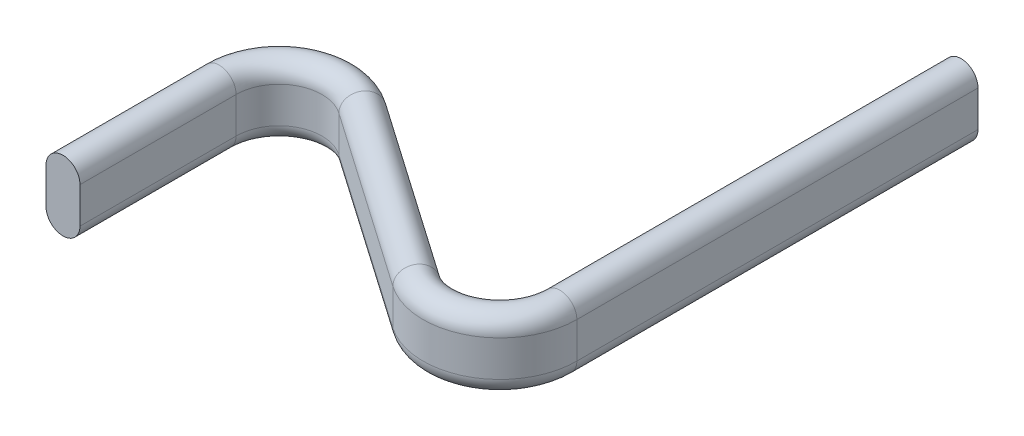
ISO-10303-21;
HEADER;
FILE_DESCRIPTION(('STEP AP214'),'2;1');
FILE_NAME('part.step','',(''),(''),'','','');
FILE_SCHEMA(('AUTOMOTIVE_DESIGN { 1 0 10303 214 1 1 1 1 }'));
ENDSEC;
DATA;
#1=APPLICATION_CONTEXT('core data for automotive mechanical design processes');
#2=APPLICATION_PROTOCOL_DEFINITION('international standard','automotive_design',2000,#1);
#3=PRODUCT_CONTEXT('',#1,'mechanical');
#4=PRODUCT('Part','Part','',(#3));
#5=PRODUCT_RELATED_PRODUCT_CATEGORY('part','',(#4));
#6=PRODUCT_DEFINITION_FORMATION('','',#4);
#7=PRODUCT_DEFINITION_CONTEXT('part definition',#1,'design');
#8=PRODUCT_DEFINITION('design','',#6,#7);
#9=PRODUCT_DEFINITION_SHAPE('','',#8);
#10=(LENGTH_UNIT() NAMED_UNIT(*) SI_UNIT(.MILLI.,.METRE.));
#11=(NAMED_UNIT(*) PLANE_ANGLE_UNIT() SI_UNIT($,.RADIAN.));
#12=(NAMED_UNIT(*) SI_UNIT($,.STERADIAN.) SOLID_ANGLE_UNIT());
#13=UNCERTAINTY_MEASURE_WITH_UNIT(LENGTH_MEASURE(1.E-05),#10,'distance_accuracy_value','');
#14=(GEOMETRIC_REPRESENTATION_CONTEXT(3) GLOBAL_UNCERTAINTY_ASSIGNED_CONTEXT((#13)) GLOBAL_UNIT_ASSIGNED_CONTEXT((#10,
#11,#12)) REPRESENTATION_CONTEXT('',''));
#15=CARTESIAN_POINT('',(0.,0.,0.));
#16=DIRECTION('',(0.,0.,1.));
#17=DIRECTION('',(1.,0.,0.));
#18=AXIS2_PLACEMENT_3D('',#15,#16,#17);
#19=CARTESIAN_POINT('',(0.,-1.8,0.));
#20=DIRECTION('',(0.,0.,1.));
#21=DIRECTION('',(1.,0.,0.));
#22=AXIS2_PLACEMENT_3D('',#19,#20,#21);
#23=PLANE('',#22);
#24=CARTESIAN_POINT('',(0.,-1.8,0.));
#25=DIRECTION('',(0.,0.,1.));
#26=DIRECTION('',(1.,0.,0.));
#27=AXIS2_PLACEMENT_3D('',#24,#25,#26);
#28=CIRCLE('',#27,1.7);
#29=CARTESIAN_POINT('',(-1.7,-1.8,0.));
#30=VERTEX_POINT('',#29);
#31=CARTESIAN_POINT('',(1.7,-1.8,0.));
#32=VERTEX_POINT('',#31);
#33=EDGE_CURVE('E151',#30,#32,#28,.T.);
#34=ORIENTED_EDGE('',*,*,#33,.T.);
#35=DIRECTION('',(0.,1.,0.));
#36=VECTOR('',#35,1.);
#37=CARTESIAN_POINT('',(1.7,-1.8,0.));
#38=LINE('',#37,#36);
#39=CARTESIAN_POINT('',(1.7,1.8,0.));
#40=VERTEX_POINT('',#39);
#41=EDGE_CURVE('E155',#32,#40,#38,.T.);
#42=ORIENTED_EDGE('',*,*,#41,.T.);
#43=CARTESIAN_POINT('',(0.,1.8,0.));
#44=DIRECTION('',(0.,0.,1.));
#45=DIRECTION('',(1.,0.,0.));
#46=AXIS2_PLACEMENT_3D('',#43,#44,#45);
#47=CIRCLE('',#46,1.7);
#48=CARTESIAN_POINT('',(-1.7,1.8,0.));
#49=VERTEX_POINT('',#48);
#50=EDGE_CURVE('E154',#40,#49,#47,.T.);
#51=ORIENTED_EDGE('',*,*,#50,.T.);
#52=DIRECTION('',(0.,-1.,0.));
#53=VECTOR('',#52,1.);
#54=CARTESIAN_POINT('',(-1.7,-1.8,0.));
#55=LINE('',#54,#53);
#56=EDGE_CURVE('E141',#49,#30,#55,.T.);
#57=ORIENTED_EDGE('',*,*,#56,.T.);
#58=EDGE_LOOP('',(#34,#42,#51,#57));
#59=FACE_BOUND('',#58,.T.);
#60=ADVANCED_FACE('F33',(#59),#23,.T.);
#61=CARTESIAN_POINT('',(36.5670970558212,-1.8,-53.3285901270254));
#62=DIRECTION('',(0.,0.,1.));
#63=DIRECTION('',(1.,0.,0.));
#64=AXIS2_PLACEMENT_3D('',#61,#62,#63);
#65=PLANE('',#64);
#66=CARTESIAN_POINT('',(36.5670970558212,-1.8,-53.3285901270254));
#67=DIRECTION('',(0.,0.,1.));
#68=DIRECTION('',(1.,0.,0.));
#69=AXIS2_PLACEMENT_3D('',#66,#67,#68);
#70=CIRCLE('',#69,1.7);
#71=CARTESIAN_POINT('',(34.8670970558212,-1.8,-53.3285901270254));
#72=VERTEX_POINT('',#71);
#73=CARTESIAN_POINT('',(38.2670970558212,-1.8,-53.3285901270254));
#74=VERTEX_POINT('',#73);
#75=EDGE_CURVE('E56',#72,#74,#70,.T.);
#76=ORIENTED_EDGE('',*,*,#75,.F.);
#77=DIRECTION('',(0.,-1.,0.));
#78=VECTOR('',#77,1.);
#79=CARTESIAN_POINT('',(34.8670970558212,-1.8,-53.3285901270254));
#80=LINE('',#79,#78);
#81=CARTESIAN_POINT('',(34.8670970558212,1.8,-53.3285901270254));
#82=VERTEX_POINT('',#81);
#83=EDGE_CURVE('E199',#82,#72,#80,.T.);
#84=ORIENTED_EDGE('',*,*,#83,.F.);
#85=CARTESIAN_POINT('',(36.5670970558212,1.8,-53.3285901270254));
#86=DIRECTION('',(0.,0.,1.));
#87=DIRECTION('',(1.,0.,0.));
#88=AXIS2_PLACEMENT_3D('',#85,#86,#87);
#89=CIRCLE('',#88,1.7);
#90=CARTESIAN_POINT('',(38.2670970558212,1.8,-53.3285901270254));
#91=VERTEX_POINT('',#90);
#92=EDGE_CURVE('E11',#91,#82,#89,.T.);
#93=ORIENTED_EDGE('',*,*,#92,.F.);
#94=DIRECTION('',(0.,1.,0.));
#95=VECTOR('',#94,1.);
#96=CARTESIAN_POINT('',(38.2670970558212,-1.8,-53.3285901270254));
#97=LINE('',#96,#95);
#98=EDGE_CURVE('E47',#74,#91,#97,.T.);
#99=ORIENTED_EDGE('',*,*,#98,.F.);
#100=EDGE_LOOP('',(#76,#84,#93,#99));
#101=FACE_BOUND('',#100,.T.);
#102=ADVANCED_FACE('F303',(#101),#65,.F.);
#103=CARTESIAN_POINT('',(-1.7,-1.8,0.));
#104=DIRECTION('',(1.,0.,0.));
#105=DIRECTION('',(0.,1.,0.));
#106=AXIS2_PLACEMENT_3D('',#103,#104,#105);
#107=PLANE('',#106);
#108=DIRECTION('',(0.,0.,-1.));
#109=VECTOR('',#108,1.);
#110=CARTESIAN_POINT('',(-1.7,-1.8,0.));
#111=LINE('',#110,#109);
#112=CARTESIAN_POINT('',(-1.7,-1.8,-15.6317225175573));
#113=VERTEX_POINT('',#112);
#114=EDGE_CURVE('E148',#30,#113,#111,.T.);
#115=ORIENTED_EDGE('',*,*,#114,.F.);
#116=ORIENTED_EDGE('',*,*,#56,.F.);
#117=DIRECTION('',(0.,0.,-1.));
#118=VECTOR('',#117,1.);
#119=CARTESIAN_POINT('',(-1.7,1.8,0.));
#120=LINE('',#119,#118);
#121=CARTESIAN_POINT('',(-1.7,1.8,-15.6317225175573));
#122=VERTEX_POINT('',#121);
#123=EDGE_CURVE('E146',#49,#122,#120,.T.);
#124=ORIENTED_EDGE('',*,*,#123,.T.);
#125=DIRECTION('',(0.,-1.,0.));
#126=VECTOR('',#125,1.);
#127=CARTESIAN_POINT('',(-1.7,-1.8,-15.6317225175573));
#128=LINE('',#127,#126);
#129=EDGE_CURVE('E165',#122,#113,#128,.T.);
#130=ORIENTED_EDGE('',*,*,#129,.T.);
#131=EDGE_LOOP('',(#115,#116,#124,#130));
#132=FACE_BOUND('',#131,.T.);
#133=ADVANCED_FACE('F143',(#132),#107,.F.);
#134=CARTESIAN_POINT('',(0.,-1.8,0.));
#135=DIRECTION('',(0.,0.,-1.));
#136=DIRECTION('',(-1.,0.,0.));
#137=AXIS2_PLACEMENT_3D('',#134,#135,#136);
#138=CYLINDRICAL_SURFACE('',#137,1.7);
#139=DIRECTION('',(0.,0.,-1.));
#140=VECTOR('',#139,1.);
#141=CARTESIAN_POINT('',(1.7,-1.8,0.));
#142=LINE('',#141,#140);
#143=CARTESIAN_POINT('',(1.7,-1.8,-15.6317225175573));
#144=VERTEX_POINT('',#143);
#145=EDGE_CURVE('E210',#32,#144,#142,.T.);
#146=ORIENTED_EDGE('',*,*,#145,.F.);
#147=ORIENTED_EDGE('',*,*,#33,.F.);
#148=ORIENTED_EDGE('',*,*,#114,.T.);
#149=CARTESIAN_POINT('',(0.,-1.8,-15.6317225175573));
#150=DIRECTION('',(0.,0.,1.));
#151=DIRECTION('',(1.,0.,0.));
#152=AXIS2_PLACEMENT_3D('',#149,#150,#151);
#153=CIRCLE('',#152,1.7);
#154=EDGE_CURVE('E207',#113,#144,#153,.T.);
#155=ORIENTED_EDGE('',*,*,#154,.T.);
#156=EDGE_LOOP('',(#146,#147,#148,#155));
#157=FACE_BOUND('',#156,.T.);
#158=ADVANCED_FACE('F310',(#157),#138,.T.);
#159=CARTESIAN_POINT('',(1.7,-1.8,0.));
#160=DIRECTION('',(-1.,0.,0.));
#161=DIRECTION('',(0.,0.,1.));
#162=AXIS2_PLACEMENT_3D('',#159,#160,#161);
#163=PLANE('',#162);
#164=DIRECTION('',(0.,0.,-1.));
#165=VECTOR('',#164,1.);
#166=CARTESIAN_POINT('',(1.7,1.8,0.));
#167=LINE('',#166,#165);
#168=CARTESIAN_POINT('',(1.7,1.8,-15.6317225175573));
#169=VERTEX_POINT('',#168);
#170=EDGE_CURVE('E234',#40,#169,#167,.T.);
#171=ORIENTED_EDGE('',*,*,#170,.F.);
#172=ORIENTED_EDGE('',*,*,#41,.F.);
#173=ORIENTED_EDGE('',*,*,#145,.T.);
#174=DIRECTION('',(0.,1.,0.));
#175=VECTOR('',#174,1.);
#176=CARTESIAN_POINT('',(1.7,-1.8,-15.6317225175573));
#177=LINE('',#176,#175);
#178=EDGE_CURVE('E213',#144,#169,#177,.T.);
#179=ORIENTED_EDGE('',*,*,#178,.T.);
#180=EDGE_LOOP('',(#171,#172,#173,#179));
#181=FACE_BOUND('',#180,.T.);
#182=ADVANCED_FACE('F297',(#181),#163,.F.);
#183=CARTESIAN_POINT('',(0.,1.8,0.));
#184=DIRECTION('',(0.,0.,-1.));
#185=DIRECTION('',(-1.,0.,0.));
#186=AXIS2_PLACEMENT_3D('',#183,#184,#185);
#187=CYLINDRICAL_SURFACE('',#186,1.7);
#188=CARTESIAN_POINT('',(0.,1.8,-15.6317225175573));
#189=DIRECTION('',(0.,0.,1.));
#190=DIRECTION('',(1.,0.,0.));
#191=AXIS2_PLACEMENT_3D('',#188,#189,#190);
#192=CIRCLE('',#191,1.7);
#193=EDGE_CURVE('E163',#169,#122,#192,.T.);
#194=ORIENTED_EDGE('',*,*,#193,.T.);
#195=ORIENTED_EDGE('',*,*,#123,.F.);
#196=ORIENTED_EDGE('',*,*,#50,.F.);
#197=ORIENTED_EDGE('',*,*,#170,.T.);
#198=EDGE_LOOP('',(#194,#195,#196,#197));
#199=FACE_BOUND('',#198,.T.);
#200=ADVANCED_FACE('F161',(#199),#187,.T.);
#201=CARTESIAN_POINT('',(6.,0.,-15.6317225175573));
#202=DIRECTION('',(0.,-1.,0.));
#203=DIRECTION('',(0.,0.,-1.));
#204=AXIS2_PLACEMENT_3D('',#201,#202,#203);
#205=CYLINDRICAL_SURFACE('',#204,7.7);
#206=CARTESIAN_POINT('',(6.,-1.8,-15.6317225175573));
#207=DIRECTION('',(0.,-1.,0.));
#208=DIRECTION('',(-1.,0.,0.));
#209=AXIS2_PLACEMENT_3D('',#206,#207,#208);
#210=CIRCLE('',#209,7.7);
#211=CARTESIAN_POINT('',(10.3941269862348,-1.8,-21.9548268207333));
#212=VERTEX_POINT('',#211);
#213=EDGE_CURVE('E173',#113,#212,#210,.T.);
#214=ORIENTED_EDGE('',*,*,#213,.F.);
#215=ORIENTED_EDGE('',*,*,#129,.F.);
#216=CARTESIAN_POINT('',(6.,1.8,-15.6317225175573));
#217=DIRECTION('',(0.,-1.,0.));
#218=DIRECTION('',(-1.,0.,0.));
#219=AXIS2_PLACEMENT_3D('',#216,#217,#218);
#220=CIRCLE('',#219,7.7);
#221=CARTESIAN_POINT('',(10.3941269862348,1.8,-21.9548268207333));
#222=VERTEX_POINT('',#221);
#223=EDGE_CURVE('E174',#122,#222,#220,.T.);
#224=ORIENTED_EDGE('',*,*,#223,.T.);
#225=DIRECTION('',(0.,-1.,0.));
#226=VECTOR('',#225,1.);
#227=CARTESIAN_POINT('',(10.3941269862348,-1.8,-21.9548268207333));
#228=LINE('',#227,#226);
#229=EDGE_CURVE('E170',#222,#212,#228,.T.);
#230=ORIENTED_EDGE('',*,*,#229,.T.);
#231=EDGE_LOOP('',(#214,#215,#224,#230));
#232=FACE_BOUND('',#231,.T.);
#233=ADVANCED_FACE('F296',(#232),#205,.T.);
#234=CARTESIAN_POINT('',(6.,-1.8,-15.6317225175573));
#235=DIRECTION('',(0.,-1.,0.));
#236=DIRECTION('',(0.,0.,-1.));
#237=AXIS2_PLACEMENT_3D('',#234,#235,#236);
#238=TOROIDAL_SURFACE('',#237,6.,1.7);
#239=CARTESIAN_POINT('',(6.,-1.8,-15.6317225175573));
#240=DIRECTION('',(0.,-1.,0.));
#241=DIRECTION('',(-1.,0.,0.));
#242=AXIS2_PLACEMENT_3D('',#239,#240,#241);
#243=CIRCLE('',#242,4.3);
#244=CARTESIAN_POINT('',(8.45386312218309,-1.8,-19.1628067388114));
#245=VERTEX_POINT('',#244);
#246=EDGE_CURVE('E216',#144,#245,#243,.T.);
#247=ORIENTED_EDGE('',*,*,#246,.F.);
#248=ORIENTED_EDGE('',*,*,#154,.F.);
#249=ORIENTED_EDGE('',*,*,#213,.T.);
#250=CARTESIAN_POINT('',(9.42399505420896,-1.8,-20.5588167797724));
#251=DIRECTION('',(-0.821182377035844,0.,-0.57066584236816));
#252=DIRECTION('',(-0.57066584236816,0.,0.821182377035844));
#253=AXIS2_PLACEMENT_3D('',#250,#251,#252);
#254=CIRCLE('',#253,1.7);
#255=EDGE_CURVE('E177',#212,#245,#254,.T.);
#256=ORIENTED_EDGE('',*,*,#255,.T.);
#257=EDGE_LOOP('',(#247,#248,#249,#256));
#258=FACE_BOUND('',#257,.T.);
#259=ADVANCED_FACE('F319',(#258),#238,.T.);
#260=CARTESIAN_POINT('',(6.,0.,-15.6317225175573));
#261=DIRECTION('',(0.,-1.,0.));
#262=DIRECTION('',(0.,0.,-1.));
#263=AXIS2_PLACEMENT_3D('',#260,#261,#262);
#264=CYLINDRICAL_SURFACE('',#263,4.3);
#265=CARTESIAN_POINT('',(6.,1.8,-15.6317225175573));
#266=DIRECTION('',(0.,-1.,0.));
#267=DIRECTION('',(-1.,0.,0.));
#268=AXIS2_PLACEMENT_3D('',#265,#266,#267);
#269=CIRCLE('',#268,4.3);
#270=CARTESIAN_POINT('',(8.45386312218309,1.8,-19.1628067388114));
#271=VERTEX_POINT('',#270);
#272=EDGE_CURVE('E238',#169,#271,#269,.T.);
#273=ORIENTED_EDGE('',*,*,#272,.F.);
#274=ORIENTED_EDGE('',*,*,#178,.F.);
#275=ORIENTED_EDGE('',*,*,#246,.T.);
#276=DIRECTION('',(0.,1.,0.));
#277=VECTOR('',#276,1.);
#278=CARTESIAN_POINT('',(8.45386312218309,-1.8,-19.1628067388114));
#279=LINE('',#278,#277);
#280=EDGE_CURVE('E219',#245,#271,#279,.T.);
#281=ORIENTED_EDGE('',*,*,#280,.T.);
#282=EDGE_LOOP('',(#273,#274,#275,#281));
#283=FACE_BOUND('',#282,.T.);
#284=ADVANCED_FACE('F275',(#283),#264,.F.);
#285=CARTESIAN_POINT('',(6.,1.8,-15.6317225175573));
#286=DIRECTION('',(0.,-1.,0.));
#287=DIRECTION('',(0.,0.,-1.));
#288=AXIS2_PLACEMENT_3D('',#285,#286,#287);
#289=TOROIDAL_SURFACE('',#288,6.,1.7);
#290=CARTESIAN_POINT('',(9.42399505420896,1.8,-20.5588167797724));
#291=DIRECTION('',(-0.821182377035844,0.,-0.57066584236816));
#292=DIRECTION('',(-0.57066584236816,0.,0.821182377035844));
#293=AXIS2_PLACEMENT_3D('',#290,#291,#292);
#294=CIRCLE('',#293,1.7);
#295=EDGE_CURVE('E190',#271,#222,#294,.T.);
#296=ORIENTED_EDGE('',*,*,#295,.T.);
#297=ORIENTED_EDGE('',*,*,#223,.F.);
#298=ORIENTED_EDGE('',*,*,#193,.F.);
#299=ORIENTED_EDGE('',*,*,#272,.T.);
#300=EDGE_LOOP('',(#296,#297,#298,#299));
#301=FACE_BOUND('',#300,.T.);
#302=ADVANCED_FACE('F271',(#301),#289,.T.);
#303=CARTESIAN_POINT('',(10.3941269862348,-1.8,-21.9548268207333));
#304=DIRECTION('',(-0.57066584236816,0.,0.821182377035843));
#305=DIRECTION('',(0.821182377035844,0.,0.57066584236816));
#306=AXIS2_PLACEMENT_3D('',#303,#304,#305);
#307=PLANE('',#306);
#308=DIRECTION('',(0.821182377035843,0.,0.57066584236816));
#309=VECTOR('',#308,1.);
#310=CARTESIAN_POINT('',(10.3941269862348,-1.8,-21.9548268207333));
#311=LINE('',#310,#309);
#312=CARTESIAN_POINT('',(28.1132339336381,-1.8,-9.64125388624003));
#313=VERTEX_POINT('',#312);
#314=EDGE_CURVE('E183',#212,#313,#311,.T.);
#315=ORIENTED_EDGE('',*,*,#314,.F.);
#316=ORIENTED_EDGE('',*,*,#229,.F.);
#317=DIRECTION('',(0.821182377035843,0.,0.57066584236816));
#318=VECTOR('',#317,1.);
#319=CARTESIAN_POINT('',(10.3941269862348,1.8,-21.9548268207333));
#320=LINE('',#319,#318);
#321=CARTESIAN_POINT('',(28.1132339336381,1.8,-9.64125388624003));
#322=VERTEX_POINT('',#321);
#323=EDGE_CURVE('E184',#222,#322,#320,.T.);
#324=ORIENTED_EDGE('',*,*,#323,.T.);
#325=DIRECTION('',(0.,-1.,0.));
#326=VECTOR('',#325,1.);
#327=CARTESIAN_POINT('',(28.1132339336381,-1.8,-9.64125388624003));
#328=LINE('',#327,#326);
#329=EDGE_CURVE('E180',#322,#313,#328,.T.);
#330=ORIENTED_EDGE('',*,*,#329,.T.);
#331=EDGE_LOOP('',(#315,#316,#324,#330));
#332=FACE_BOUND('',#331,.T.);
#333=ADVANCED_FACE('F266',(#332),#307,.F.);
#334=CARTESIAN_POINT('',(9.42399505420896,-1.8,-20.5588167797724));
#335=DIRECTION('',(0.821182377035843,0.,0.57066584236816));
#336=DIRECTION('',(0.57066584236816,0.,-0.821182377035844));
#337=AXIS2_PLACEMENT_3D('',#334,#335,#336);
#338=CYLINDRICAL_SURFACE('',#337,1.7);
#339=DIRECTION('',(0.821182377035843,0.,0.57066584236816));
#340=VECTOR('',#339,1.);
#341=CARTESIAN_POINT('',(8.45386312218309,-1.8,-19.1628067388114));
#342=LINE('',#341,#340);
#343=CARTESIAN_POINT('',(26.1729700695864,-1.8,-6.84923380431817));
#344=VERTEX_POINT('',#343);
#345=EDGE_CURVE('E222',#245,#344,#342,.T.);
#346=ORIENTED_EDGE('',*,*,#345,.F.);
#347=ORIENTED_EDGE('',*,*,#255,.F.);
#348=ORIENTED_EDGE('',*,*,#314,.T.);
#349=CARTESIAN_POINT('',(27.1431020016122,-1.8,-8.2452438452791));
#350=DIRECTION('',(-0.821182377035843,0.,-0.57066584236816));
#351=DIRECTION('',(-0.57066584236816,0.,0.821182377035843));
#352=AXIS2_PLACEMENT_3D('',#349,#350,#351);
#353=CIRCLE('',#352,1.7);
#354=EDGE_CURVE('E187',#313,#344,#353,.T.);
#355=ORIENTED_EDGE('',*,*,#354,.T.);
#356=EDGE_LOOP('',(#346,#347,#348,#355));
#357=FACE_BOUND('',#356,.T.);
#358=ADVANCED_FACE('F316',(#357),#338,.T.);
#359=CARTESIAN_POINT('',(8.45386312218309,-1.8,-19.1628067388114));
#360=DIRECTION('',(0.57066584236816,0.,-0.821182377035843));
#361=DIRECTION('',(-0.821182377035844,0.,-0.57066584236816));
#362=AXIS2_PLACEMENT_3D('',#359,#360,#361);
#363=PLANE('',#362);
#364=DIRECTION('',(0.821182377035843,0.,0.57066584236816));
#365=VECTOR('',#364,1.);
#366=CARTESIAN_POINT('',(8.45386312218309,1.8,-19.1628067388114));
#367=LINE('',#366,#365);
#368=CARTESIAN_POINT('',(26.1729700695864,1.8,-6.84923380431817));
#369=VERTEX_POINT('',#368);
#370=EDGE_CURVE('E243',#271,#369,#367,.T.);
#371=ORIENTED_EDGE('',*,*,#370,.F.);
#372=ORIENTED_EDGE('',*,*,#280,.F.);
#373=ORIENTED_EDGE('',*,*,#345,.T.);
#374=DIRECTION('',(0.,1.,0.));
#375=VECTOR('',#374,1.);
#376=CARTESIAN_POINT('',(26.1729700695864,-1.8,-6.84923380431816));
#377=LINE('',#376,#375);
#378=EDGE_CURVE('E225',#344,#369,#377,.T.);
#379=ORIENTED_EDGE('',*,*,#378,.T.);
#380=EDGE_LOOP('',(#371,#372,#373,#379));
#381=FACE_BOUND('',#380,.T.);
#382=ADVANCED_FACE('F277',(#381),#363,.F.);
#383=CARTESIAN_POINT('',(9.42399505420896,1.8,-20.5588167797724));
#384=DIRECTION('',(0.821182377035843,0.,0.57066584236816));
#385=DIRECTION('',(0.57066584236816,0.,-0.821182377035844));
#386=AXIS2_PLACEMENT_3D('',#383,#384,#385);
#387=CYLINDRICAL_SURFACE('',#386,1.7);
#388=CARTESIAN_POINT('',(27.1431020016122,1.8,-8.2452438452791));
#389=DIRECTION('',(-0.821182377035843,0.,-0.57066584236816));
#390=DIRECTION('',(-0.57066584236816,0.,0.821182377035843));
#391=AXIS2_PLACEMENT_3D('',#388,#389,#390);
#392=CIRCLE('',#391,1.7);
#393=EDGE_CURVE('E198',#369,#322,#392,.T.);
#394=ORIENTED_EDGE('',*,*,#393,.T.);
#395=ORIENTED_EDGE('',*,*,#323,.F.);
#396=ORIENTED_EDGE('',*,*,#295,.F.);
#397=ORIENTED_EDGE('',*,*,#370,.T.);
#398=EDGE_LOOP('',(#394,#395,#396,#397));
#399=FACE_BOUND('',#398,.T.);
#400=ADVANCED_FACE('F269',(#399),#387,.T.);
#401=CARTESIAN_POINT('',(30.5670970558212,0.,-13.1723381074942));
#402=DIRECTION('',(0.,1.,0.));
#403=DIRECTION('',(0.,0.,1.));
#404=AXIS2_PLACEMENT_3D('',#401,#402,#403);
#405=CYLINDRICAL_SURFACE('',#404,4.3);
#406=CARTESIAN_POINT('',(30.5670970558212,-1.8,-13.1723381074942));
#407=DIRECTION('',(0.,1.,0.));
#408=DIRECTION('',(-0.570665842368161,0.,0.821182377035843));
#409=AXIS2_PLACEMENT_3D('',#406,#407,#408);
#410=CIRCLE('',#409,4.3);
#411=CARTESIAN_POINT('',(34.8670970558212,-1.8,-13.1723381074942));
#412=VERTEX_POINT('',#411);
#413=EDGE_CURVE('E121',#313,#412,#410,.T.);
#414=ORIENTED_EDGE('',*,*,#413,.F.);
#415=ORIENTED_EDGE('',*,*,#329,.F.);
#416=CARTESIAN_POINT('',(30.5670970558212,1.8,-13.1723381074942));
#417=DIRECTION('',(0.,1.,0.));
#418=DIRECTION('',(-0.570665842368161,0.,0.821182377035843));
#419=AXIS2_PLACEMENT_3D('',#416,#417,#418);
#420=CIRCLE('',#419,4.3);
#421=CARTESIAN_POINT('',(34.8670970558212,1.8,-13.1723381074942));
#422=VERTEX_POINT('',#421);
#423=EDGE_CURVE('E193',#322,#422,#420,.T.);
#424=ORIENTED_EDGE('',*,*,#423,.T.);
#425=DIRECTION('',(0.,-1.,0.));
#426=VECTOR('',#425,1.);
#427=CARTESIAN_POINT('',(34.8670970558212,-1.8,-13.1723381074942));
#428=LINE('',#427,#426);
#429=EDGE_CURVE('E191',#422,#412,#428,.T.);
#430=ORIENTED_EDGE('',*,*,#429,.T.);
#431=EDGE_LOOP('',(#414,#415,#424,#430));
#432=FACE_BOUND('',#431,.T.);
#433=ADVANCED_FACE('F263',(#432),#405,.F.);
#434=CARTESIAN_POINT('',(30.5670970558212,-1.8,-13.1723381074942));
#435=DIRECTION('',(0.,1.,0.));
#436=DIRECTION('',(0.,0.,1.));
#437=AXIS2_PLACEMENT_3D('',#434,#435,#436);
#438=TOROIDAL_SURFACE('',#437,6.,1.7);
#439=CARTESIAN_POINT('',(30.5670970558212,-1.8,-13.1723381074942));
#440=DIRECTION('',(0.,1.,0.));
#441=DIRECTION('',(-0.57066584236816,0.,0.821182377035843));
#442=AXIS2_PLACEMENT_3D('',#439,#440,#441);
#443=CIRCLE('',#442,7.7);
#444=CARTESIAN_POINT('',(38.2670970558212,-1.8,-13.1723381074942));
#445=VERTEX_POINT('',#444);
#446=EDGE_CURVE('E114',#344,#445,#443,.T.);
#447=ORIENTED_EDGE('',*,*,#446,.F.);
#448=ORIENTED_EDGE('',*,*,#354,.F.);
#449=ORIENTED_EDGE('',*,*,#413,.T.);
#450=CARTESIAN_POINT('',(36.5670970558212,-1.8,-13.1723381074942));
#451=DIRECTION('',(0.,0.,1.));
#452=DIRECTION('',(1.,0.,0.));
#453=AXIS2_PLACEMENT_3D('',#450,#451,#452);
#454=CIRCLE('',#453,1.7);
#455=EDGE_CURVE('E195',#412,#445,#454,.T.);
#456=ORIENTED_EDGE('',*,*,#455,.T.);
#457=EDGE_LOOP('',(#447,#448,#449,#456));
#458=FACE_BOUND('',#457,.T.);
#459=ADVANCED_FACE('F313',(#458),#438,.T.);
#460=CARTESIAN_POINT('',(30.5670970558212,0.,-13.1723381074942));
#461=DIRECTION('',(0.,1.,0.));
#462=DIRECTION('',(0.,0.,1.));
#463=AXIS2_PLACEMENT_3D('',#460,#461,#462);
#464=CYLINDRICAL_SURFACE('',#463,7.7);
#465=CARTESIAN_POINT('',(30.5670970558212,1.8,-13.1723381074942));
#466=DIRECTION('',(0.,1.,0.));
#467=DIRECTION('',(-0.57066584236816,0.,0.821182377035843));
#468=AXIS2_PLACEMENT_3D('',#465,#466,#467);
#469=CIRCLE('',#468,7.7);
#470=CARTESIAN_POINT('',(38.2670970558212,1.8,-13.1723381074942));
#471=VERTEX_POINT('',#470);
#472=EDGE_CURVE('E248',#369,#471,#469,.T.);
#473=ORIENTED_EDGE('',*,*,#472,.F.);
#474=ORIENTED_EDGE('',*,*,#378,.F.);
#475=ORIENTED_EDGE('',*,*,#446,.T.);
#476=DIRECTION('',(0.,1.,0.));
#477=VECTOR('',#476,1.);
#478=CARTESIAN_POINT('',(38.2670970558212,-1.8,-13.1723381074942));
#479=LINE('',#478,#477);
#480=EDGE_CURVE('E228',#445,#471,#479,.T.);
#481=ORIENTED_EDGE('',*,*,#480,.T.);
#482=EDGE_LOOP('',(#473,#474,#475,#481));
#483=FACE_BOUND('',#482,.T.);
#484=ADVANCED_FACE('F279',(#483),#464,.T.);
#485=CARTESIAN_POINT('',(30.5670970558212,1.8,-13.1723381074942));
#486=DIRECTION('',(0.,1.,0.));
#487=DIRECTION('',(0.,0.,1.));
#488=AXIS2_PLACEMENT_3D('',#485,#486,#487);
#489=TOROIDAL_SURFACE('',#488,6.,1.7);
#490=CARTESIAN_POINT('',(36.5670970558212,1.8,-13.1723381074942));
#491=DIRECTION('',(0.,0.,1.));
#492=DIRECTION('',(1.,0.,0.));
#493=AXIS2_PLACEMENT_3D('',#490,#491,#492);
#494=CIRCLE('',#493,1.7);
#495=EDGE_CURVE('E205',#471,#422,#494,.T.);
#496=ORIENTED_EDGE('',*,*,#495,.T.);
#497=ORIENTED_EDGE('',*,*,#423,.F.);
#498=ORIENTED_EDGE('',*,*,#393,.F.);
#499=ORIENTED_EDGE('',*,*,#472,.T.);
#500=EDGE_LOOP('',(#496,#497,#498,#499));
#501=FACE_BOUND('',#500,.T.);
#502=ADVANCED_FACE('F259',(#501),#489,.T.);
#503=CARTESIAN_POINT('',(34.8670970558212,-1.8,-13.1723381074942));
#504=DIRECTION('',(1.,0.,0.));
#505=DIRECTION('',(0.,0.,-1.));
#506=AXIS2_PLACEMENT_3D('',#503,#504,#505);
#507=PLANE('',#506);
#508=DIRECTION('',(0.,0.,-1.));
#509=VECTOR('',#508,1.);
#510=CARTESIAN_POINT('',(34.8670970558212,-1.8,-13.1723381074942));
#511=LINE('',#510,#509);
#512=EDGE_CURVE('E95',#412,#72,#511,.T.);
#513=ORIENTED_EDGE('',*,*,#512,.F.);
#514=ORIENTED_EDGE('',*,*,#429,.F.);
#515=DIRECTION('',(0.,0.,-1.));
#516=VECTOR('',#515,1.);
#517=CARTESIAN_POINT('',(34.8670970558212,1.8,-13.1723381074942));
#518=LINE('',#517,#516);
#519=EDGE_CURVE('E201',#422,#82,#518,.T.);
#520=ORIENTED_EDGE('',*,*,#519,.T.);
#521=ORIENTED_EDGE('',*,*,#83,.T.);
#522=EDGE_LOOP('',(#513,#514,#520,#521));
#523=FACE_BOUND('',#522,.T.);
#524=ADVANCED_FACE('F262',(#523),#507,.F.);
#525=CARTESIAN_POINT('',(36.5670970558212,-1.8,-13.1723381074942));
#526=DIRECTION('',(0.,0.,-1.));
#527=DIRECTION('',(-1.,0.,0.));
#528=AXIS2_PLACEMENT_3D('',#525,#526,#527);
#529=CYLINDRICAL_SURFACE('',#528,1.7);
#530=DIRECTION('',(0.,0.,-1.));
#531=VECTOR('',#530,1.);
#532=CARTESIAN_POINT('',(38.2670970558212,-1.8,-13.1723381074942));
#533=LINE('',#532,#531);
#534=EDGE_CURVE('E90',#445,#74,#533,.T.);
#535=ORIENTED_EDGE('',*,*,#534,.F.);
#536=ORIENTED_EDGE('',*,*,#455,.F.);
#537=ORIENTED_EDGE('',*,*,#512,.T.);
#538=ORIENTED_EDGE('',*,*,#75,.T.);
#539=EDGE_LOOP('',(#535,#536,#537,#538));
#540=FACE_BOUND('',#539,.T.);
#541=ADVANCED_FACE('F283',(#540),#529,.T.);
#542=CARTESIAN_POINT('',(38.2670970558212,-1.8,-13.1723381074942));
#543=DIRECTION('',(-1.,0.,0.));
#544=DIRECTION('',(0.,0.,1.));
#545=AXIS2_PLACEMENT_3D('',#542,#543,#544);
#546=PLANE('',#545);
#547=DIRECTION('',(0.,0.,-1.));
#548=VECTOR('',#547,1.);
#549=CARTESIAN_POINT('',(38.2670970558212,1.8,-13.1723381074942));
#550=LINE('',#549,#548);
#551=EDGE_CURVE('E40',#471,#91,#550,.T.);
#552=ORIENTED_EDGE('',*,*,#551,.F.);
#553=ORIENTED_EDGE('',*,*,#480,.F.);
#554=ORIENTED_EDGE('',*,*,#534,.T.);
#555=ORIENTED_EDGE('',*,*,#98,.T.);
#556=EDGE_LOOP('',(#552,#553,#554,#555));
#557=FACE_BOUND('',#556,.T.);
#558=ADVANCED_FACE('F280',(#557),#546,.F.);
#559=CARTESIAN_POINT('',(36.5670970558212,1.8,-13.1723381074942));
#560=DIRECTION('',(0.,0.,-1.));
#561=DIRECTION('',(-1.,0.,0.));
#562=AXIS2_PLACEMENT_3D('',#559,#560,#561);
#563=CYLINDRICAL_SURFACE('',#562,1.7);
#564=ORIENTED_EDGE('',*,*,#92,.T.);
#565=ORIENTED_EDGE('',*,*,#519,.F.);
#566=ORIENTED_EDGE('',*,*,#495,.F.);
#567=ORIENTED_EDGE('',*,*,#551,.T.);
#568=EDGE_LOOP('',(#564,#565,#566,#567));
#569=FACE_BOUND('',#568,.T.);
#570=ADVANCED_FACE('F282',(#569),#563,.T.);
#571=CLOSED_SHELL('',(#60,#102,#133,#158,#182,#200,#233,#259,#284,#302,#333,#358,#382,#400,#433,
#459,#484,#502,#524,#541,#558,#570));
#572=MANIFOLD_SOLID_BREP('B2',#571);
#573=ADVANCED_BREP_SHAPE_REPRESENTATION('',(#18,#572),#14);
#574=SHAPE_DEFINITION_REPRESENTATION(#9,#573);
ENDSEC;
END-ISO-10303-21;
